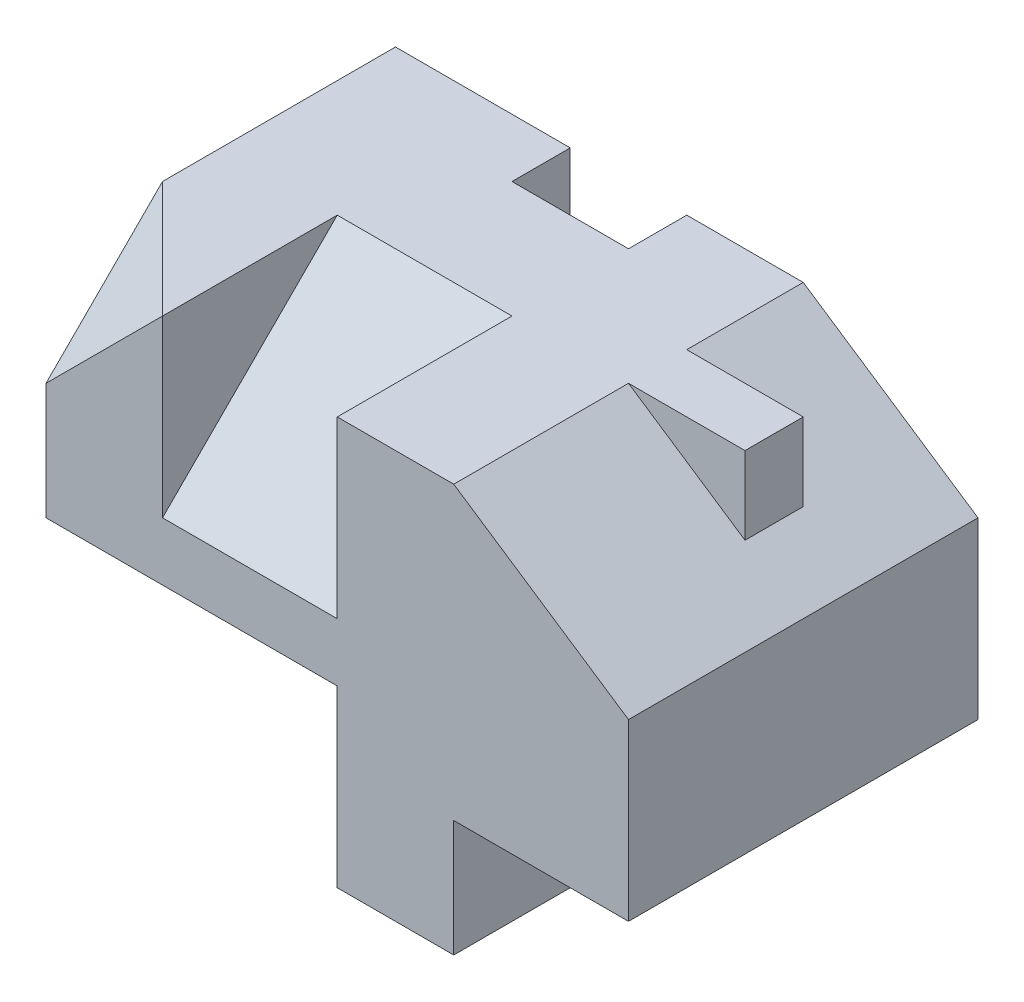
ISO-10303-21;
HEADER;
FILE_DESCRIPTION(('STEP AP214'),'2;1');
FILE_NAME('part.step','',(''),(''),'','','');
FILE_SCHEMA(('AUTOMOTIVE_DESIGN { 1 0 10303 214 1 1 1 1 }'));
ENDSEC;
DATA;
#1=APPLICATION_CONTEXT('core data for automotive mechanical design processes');
#2=APPLICATION_PROTOCOL_DEFINITION('international standard','automotive_design',2000,#1);
#3=PRODUCT_CONTEXT('',#1,'mechanical');
#4=PRODUCT('Part','Part','',(#3));
#5=PRODUCT_RELATED_PRODUCT_CATEGORY('part','',(#4));
#6=PRODUCT_DEFINITION_FORMATION('','',#4);
#7=PRODUCT_DEFINITION_CONTEXT('part definition',#1,'design');
#8=PRODUCT_DEFINITION('design','',#6,#7);
#9=PRODUCT_DEFINITION_SHAPE('','',#8);
#10=(LENGTH_UNIT() NAMED_UNIT(*) SI_UNIT(.MILLI.,.METRE.));
#11=(NAMED_UNIT(*) PLANE_ANGLE_UNIT() SI_UNIT($,.RADIAN.));
#12=(NAMED_UNIT(*) SI_UNIT($,.STERADIAN.) SOLID_ANGLE_UNIT());
#13=UNCERTAINTY_MEASURE_WITH_UNIT(LENGTH_MEASURE(1.E-05),#10,'distance_accuracy_value','');
#14=(GEOMETRIC_REPRESENTATION_CONTEXT(3) GLOBAL_UNCERTAINTY_ASSIGNED_CONTEXT((#13)) GLOBAL_UNIT_ASSIGNED_CONTEXT((#10,
#11,#12)) REPRESENTATION_CONTEXT('',''));
#15=CARTESIAN_POINT('',(0.,0.,0.));
#16=DIRECTION('',(0.,0.,1.));
#17=DIRECTION('',(1.,0.,0.));
#18=AXIS2_PLACEMENT_3D('',#15,#16,#17);
#19=CARTESIAN_POINT('',(0.,3.,0.));
#20=DIRECTION('',(0.,1.,0.));
#21=DIRECTION('',(0.,0.,1.));
#22=AXIS2_PLACEMENT_3D('',#19,#20,#21);
#23=PLANE('',#22);
#24=DIRECTION('',(0.,0.,1.));
#25=VECTOR('',#24,1.);
#26=CARTESIAN_POINT('',(5.,3.,-2.));
#27=LINE('',#26,#25);
#28=CARTESIAN_POINT('',(5.,3.,-2.));
#29=VERTEX_POINT('',#28);
#30=CARTESIAN_POINT('',(5.,3.,-1.));
#31=VERTEX_POINT('',#30);
#32=EDGE_CURVE('E332',#29,#31,#27,.T.);
#33=ORIENTED_EDGE('',*,*,#32,.T.);
#34=DIRECTION('',(1.,0.,0.));
#35=VECTOR('',#34,1.);
#36=CARTESIAN_POINT('',(0.,3.,-1.));
#37=LINE('',#36,#35);
#38=CARTESIAN_POINT('',(7.,3.,-1.));
#39=VERTEX_POINT('',#38);
#40=EDGE_CURVE('E274',#31,#39,#37,.T.);
#41=ORIENTED_EDGE('',*,*,#40,.T.);
#42=DIRECTION('',(0.,0.,-1.));
#43=VECTOR('',#42,1.);
#44=CARTESIAN_POINT('',(7.,3.,5.));
#45=LINE('',#44,#43);
#46=CARTESIAN_POINT('',(7.,3.,-2.));
#47=VERTEX_POINT('',#46);
#48=EDGE_CURVE('E324',#39,#47,#45,.T.);
#49=ORIENTED_EDGE('',*,*,#48,.T.);
#50=DIRECTION('',(-1.,0.,0.));
#51=VECTOR('',#50,1.);
#52=CARTESIAN_POINT('',(7.,3.,-2.));
#53=LINE('',#52,#51);
#54=EDGE_CURVE('E330',#47,#29,#53,.T.);
#55=ORIENTED_EDGE('',*,*,#54,.T.);
#56=EDGE_LOOP('',(#33,#41,#49,#55));
#57=FACE_BOUND('',#56,.T.);
#58=ADVANCED_FACE('F36',(#57),#23,.T.);
#59=CARTESIAN_POINT('',(0.,3.,-2.));
#60=DIRECTION('',(1.,0.,0.));
#61=DIRECTION('',(0.,0.,-1.));
#62=AXIS2_PLACEMENT_3D('',#59,#60,#61);
#63=PLANE('',#62);
#64=DIRECTION('',(0.,-1.,0.));
#65=VECTOR('',#64,1.);
#66=CARTESIAN_POINT('',(0.,7.,5.));
#67=LINE('',#66,#65);
#68=CARTESIAN_POINT('',(0.,5.,5.));
#69=VERTEX_POINT('',#68);
#70=CARTESIAN_POINT('',(0.,3.,5.));
#71=VERTEX_POINT('',#70);
#72=EDGE_CURVE('E262',#69,#71,#67,.T.);
#73=ORIENTED_EDGE('',*,*,#72,.F.);
#74=DIRECTION('',(0.,-0.707106781186548,0.707106781186548));
#75=VECTOR('',#74,1.);
#76=CARTESIAN_POINT('',(0.,7.,3.));
#77=LINE('',#76,#75);
#78=CARTESIAN_POINT('',(0.,7.,3.));
#79=VERTEX_POINT('',#78);
#80=EDGE_CURVE('E422',#79,#69,#77,.T.);
#81=ORIENTED_EDGE('',*,*,#80,.F.);
#82=DIRECTION('',(0.,0.,1.));
#83=VECTOR('',#82,1.);
#84=CARTESIAN_POINT('',(0.,7.,0.));
#85=LINE('',#84,#83);
#86=CARTESIAN_POINT('',(0.,7.,-1.));
#87=VERTEX_POINT('',#86);
#88=EDGE_CURVE('E292',#87,#79,#85,.T.);
#89=ORIENTED_EDGE('',*,*,#88,.F.);
#90=DIRECTION('',(0.,-1.,0.));
#91=VECTOR('',#90,1.);
#92=CARTESIAN_POINT('',(0.,7.,-1.));
#93=LINE('',#92,#91);
#94=CARTESIAN_POINT('',(0.,3.,-1.));
#95=VERTEX_POINT('',#94);
#96=EDGE_CURVE('E258',#87,#95,#93,.T.);
#97=ORIENTED_EDGE('',*,*,#96,.T.);
#98=DIRECTION('',(0.,0.,1.));
#99=VECTOR('',#98,1.);
#100=CARTESIAN_POINT('',(0.,3.,-2.));
#101=LINE('',#100,#99);
#102=CARTESIAN_POINT('',(0.,3.,-2.));
#103=VERTEX_POINT('',#102);
#104=EDGE_CURVE('E319',#103,#95,#101,.T.);
#105=ORIENTED_EDGE('',*,*,#104,.F.);
#106=DIRECTION('',(0.,-1.,0.));
#107=VECTOR('',#106,1.);
#108=CARTESIAN_POINT('',(0.,3.,-2.));
#109=LINE('',#108,#107);
#110=CARTESIAN_POINT('',(0.,0.,-2.));
#111=VERTEX_POINT('',#110);
#112=EDGE_CURVE('E342',#103,#111,#109,.T.);
#113=ORIENTED_EDGE('',*,*,#112,.T.);
#114=DIRECTION('',(0.,0.,1.));
#115=VECTOR('',#114,1.);
#116=CARTESIAN_POINT('',(0.,0.,-2.));
#117=LINE('',#116,#115);
#118=CARTESIAN_POINT('',(0.,0.,0.));
#119=VERTEX_POINT('',#118);
#120=EDGE_CURVE('E267',#111,#119,#117,.T.);
#121=ORIENTED_EDGE('',*,*,#120,.T.);
#122=DIRECTION('',(0.,-1.,0.));
#123=VECTOR('',#122,1.);
#124=CARTESIAN_POINT('',(0.,3.,0.));
#125=LINE('',#124,#123);
#126=CARTESIAN_POINT('',(0.,3.,0.));
#127=VERTEX_POINT('',#126);
#128=EDGE_CURVE('E45',#127,#119,#125,.T.);
#129=ORIENTED_EDGE('',*,*,#128,.F.);
#130=DIRECTION('',(0.,0.,1.));
#131=VECTOR('',#130,1.);
#132=CARTESIAN_POINT('',(0.,3.,0.));
#133=LINE('',#132,#131);
#134=EDGE_CURVE('E253',#127,#71,#133,.T.);
#135=ORIENTED_EDGE('',*,*,#134,.T.);
#136=EDGE_LOOP('',(#73,#81,#89,#97,#105,#113,#121,#129,#135));
#137=FACE_BOUND('',#136,.T.);
#138=ADVANCED_FACE('F38',(#137),#63,.F.);
#139=CARTESIAN_POINT('',(0.,3.,0.));
#140=DIRECTION('',(0.,0.,-1.));
#141=DIRECTION('',(-1.,0.,0.));
#142=AXIS2_PLACEMENT_3D('',#139,#140,#141);
#143=PLANE('',#142);
#144=DIRECTION('',(1.,0.,0.));
#145=VECTOR('',#144,1.);
#146=CARTESIAN_POINT('',(0.,0.,0.));
#147=LINE('',#146,#145);
#148=CARTESIAN_POINT('',(2.,0.,0.));
#149=VERTEX_POINT('',#148);
#150=EDGE_CURVE('E351',#119,#149,#147,.T.);
#151=ORIENTED_EDGE('',*,*,#150,.T.);
#152=DIRECTION('',(0.,-1.,0.));
#153=VECTOR('',#152,1.);
#154=CARTESIAN_POINT('',(2.,3.,0.));
#155=LINE('',#154,#153);
#156=CARTESIAN_POINT('',(2.,3.,0.));
#157=VERTEX_POINT('',#156);
#158=EDGE_CURVE('E316',#157,#149,#155,.T.);
#159=ORIENTED_EDGE('',*,*,#158,.F.);
#160=DIRECTION('',(1.,0.,0.));
#161=VECTOR('',#160,1.);
#162=CARTESIAN_POINT('',(0.,3.,0.));
#163=LINE('',#162,#161);
#164=EDGE_CURVE('E322',#127,#157,#163,.T.);
#165=ORIENTED_EDGE('',*,*,#164,.F.);
#166=ORIENTED_EDGE('',*,*,#128,.T.);
#167=EDGE_LOOP('',(#151,#159,#165,#166));
#168=FACE_BOUND('',#167,.T.);
#169=ADVANCED_FACE('F513',(#168),#143,.F.);
#170=CARTESIAN_POINT('',(2.,3.,0.));
#171=DIRECTION('',(0.857492925712544,0.,-0.514495755427527));
#172=DIRECTION('',(-0.514495755427527,0.,-0.857492925712544));
#173=AXIS2_PLACEMENT_3D('',#170,#171,#172);
#174=PLANE('',#173);
#175=DIRECTION('',(0.514495755427527,0.,0.857492925712544));
#176=VECTOR('',#175,1.);
#177=CARTESIAN_POINT('',(2.,0.,0.));
#178=LINE('',#177,#176);
#179=CARTESIAN_POINT('',(5.,0.,5.));
#180=VERTEX_POINT('',#179);
#181=EDGE_CURVE('E353',#149,#180,#178,.T.);
#182=ORIENTED_EDGE('',*,*,#181,.T.);
#183=DIRECTION('',(0.,-1.,0.));
#184=VECTOR('',#183,1.);
#185=CARTESIAN_POINT('',(5.,3.,5.));
#186=LINE('',#185,#184);
#187=CARTESIAN_POINT('',(5.,3.,5.));
#188=VERTEX_POINT('',#187);
#189=EDGE_CURVE('E308',#188,#180,#186,.T.);
#190=ORIENTED_EDGE('',*,*,#189,.F.);
#191=DIRECTION('',(0.514495755427527,0.,0.857492925712544));
#192=VECTOR('',#191,1.);
#193=CARTESIAN_POINT('',(2.,3.,0.));
#194=LINE('',#193,#192);
#195=EDGE_CURVE('E280',#157,#188,#194,.T.);
#196=ORIENTED_EDGE('',*,*,#195,.F.);
#197=ORIENTED_EDGE('',*,*,#158,.T.);
#198=EDGE_LOOP('',(#182,#190,#196,#197));
#199=FACE_BOUND('',#198,.T.);
#200=ADVANCED_FACE('F573',(#199),#174,.F.);
#201=CARTESIAN_POINT('',(5.,3.,5.));
#202=DIRECTION('',(0.,0.,-1.));
#203=DIRECTION('',(-1.,0.,0.));
#204=AXIS2_PLACEMENT_3D('',#201,#202,#203);
#205=PLANE('',#204);
#206=DIRECTION('',(0.,1.,0.));
#207=VECTOR('',#206,1.);
#208=CARTESIAN_POINT('',(2.,4.,5.));
#209=LINE('',#208,#207);
#210=CARTESIAN_POINT('',(2.,4.,5.));
#211=VERTEX_POINT('',#210);
#212=CARTESIAN_POINT('',(2.,7.,5.));
#213=VERTEX_POINT('',#212);
#214=EDGE_CURVE('E298',#211,#213,#209,.T.);
#215=ORIENTED_EDGE('',*,*,#214,.T.);
#216=DIRECTION('',(0.707106781186547,0.707106781186548,0.));
#217=VECTOR('',#216,1.);
#218=CARTESIAN_POINT('',(0.,5.,5.));
#219=LINE('',#218,#217);
#220=EDGE_CURVE('E427',#69,#213,#219,.T.);
#221=ORIENTED_EDGE('',*,*,#220,.F.);
#222=ORIENTED_EDGE('',*,*,#72,.T.);
#223=DIRECTION('',(1.,0.,0.));
#224=VECTOR('',#223,1.);
#225=CARTESIAN_POINT('',(0.,3.,5.));
#226=LINE('',#225,#224);
#227=EDGE_CURVE('E279',#71,#188,#226,.T.);
#228=ORIENTED_EDGE('',*,*,#227,.T.);
#229=ORIENTED_EDGE('',*,*,#189,.T.);
#230=DIRECTION('',(1.,0.,0.));
#231=VECTOR('',#230,1.);
#232=CARTESIAN_POINT('',(5.,0.,5.));
#233=LINE('',#232,#231);
#234=CARTESIAN_POINT('',(7.,0.,5.));
#235=VERTEX_POINT('',#234);
#236=EDGE_CURVE('E355',#180,#235,#233,.T.);
#237=ORIENTED_EDGE('',*,*,#236,.T.);
#238=DIRECTION('',(0.,-1.,0.));
#239=VECTOR('',#238,1.);
#240=CARTESIAN_POINT('',(7.,3.,5.));
#241=LINE('',#240,#239);
#242=CARTESIAN_POINT('',(7.,2.,5.));
#243=VERTEX_POINT('',#242);
#244=EDGE_CURVE('E306',#243,#235,#241,.T.);
#245=ORIENTED_EDGE('',*,*,#244,.F.);
#246=DIRECTION('',(1.,0.,0.));
#247=VECTOR('',#246,1.);
#248=CARTESIAN_POINT('',(10.,2.,5.));
#249=LINE('',#248,#247);
#250=CARTESIAN_POINT('',(10.,2.,5.));
#251=VERTEX_POINT('',#250);
#252=EDGE_CURVE('E443',#243,#251,#249,.T.);
#253=ORIENTED_EDGE('',*,*,#252,.T.);
#254=DIRECTION('',(0.,1.,0.));
#255=VECTOR('',#254,1.);
#256=CARTESIAN_POINT('',(10.,5.,5.));
#257=LINE('',#256,#255);
#258=CARTESIAN_POINT('',(10.,5.,5.));
#259=VERTEX_POINT('',#258);
#260=EDGE_CURVE('E445',#251,#259,#257,.T.);
#261=ORIENTED_EDGE('',*,*,#260,.T.);
#262=DIRECTION('',(-0.832050294337844,0.554700196225229,0.));
#263=VECTOR('',#262,1.);
#264=CARTESIAN_POINT('',(7.,7.,5.));
#265=LINE('',#264,#263);
#266=CARTESIAN_POINT('',(7.,7.,5.));
#267=VERTEX_POINT('',#266);
#268=EDGE_CURVE('E452',#259,#267,#265,.T.);
#269=ORIENTED_EDGE('',*,*,#268,.T.);
#270=DIRECTION('',(1.,0.,0.));
#271=VECTOR('',#270,1.);
#272=CARTESIAN_POINT('',(0.,7.,5.));
#273=LINE('',#272,#271);
#274=CARTESIAN_POINT('',(5.,7.,5.));
#275=VERTEX_POINT('',#274);
#276=EDGE_CURVE('E228',#275,#267,#273,.T.);
#277=ORIENTED_EDGE('',*,*,#276,.F.);
#278=DIRECTION('',(0.,1.,0.));
#279=VECTOR('',#278,1.);
#280=CARTESIAN_POINT('',(5.,4.,5.));
#281=LINE('',#280,#279);
#282=CARTESIAN_POINT('',(5.,4.,5.));
#283=VERTEX_POINT('',#282);
#284=EDGE_CURVE('E417',#283,#275,#281,.T.);
#285=ORIENTED_EDGE('',*,*,#284,.F.);
#286=DIRECTION('',(1.,0.,0.));
#287=VECTOR('',#286,1.);
#288=CARTESIAN_POINT('',(2.,4.,5.));
#289=LINE('',#288,#287);
#290=EDGE_CURVE('E254',#211,#283,#289,.T.);
#291=ORIENTED_EDGE('',*,*,#290,.F.);
#292=EDGE_LOOP('',(#215,#221,#222,#228,#229,#237,#245,#253,#261,#269,#277,#285,#291));
#293=FACE_BOUND('',#292,.T.);
#294=ADVANCED_FACE('F474',(#293),#205,.F.);
#295=CARTESIAN_POINT('',(7.,3.,5.));
#296=DIRECTION('',(-1.,0.,0.));
#297=DIRECTION('',(0.,0.,1.));
#298=AXIS2_PLACEMENT_3D('',#295,#296,#297);
#299=PLANE('',#298);
#300=DIRECTION('',(0.,-1.,0.));
#301=VECTOR('',#300,1.);
#302=CARTESIAN_POINT('',(7.,2.,-1.));
#303=LINE('',#302,#301);
#304=CARTESIAN_POINT('',(7.,2.,-1.));
#305=VERTEX_POINT('',#304);
#306=EDGE_CURVE('E12',#39,#305,#303,.T.);
#307=ORIENTED_EDGE('',*,*,#306,.T.);
#308=DIRECTION('',(0.,0.,1.));
#309=VECTOR('',#308,1.);
#310=CARTESIAN_POINT('',(7.,2.,-1.));
#311=LINE('',#310,#309);
#312=EDGE_CURVE('E441',#305,#243,#311,.T.);
#313=ORIENTED_EDGE('',*,*,#312,.T.);
#314=ORIENTED_EDGE('',*,*,#244,.T.);
#315=DIRECTION('',(0.,0.,-1.));
#316=VECTOR('',#315,1.);
#317=CARTESIAN_POINT('',(7.,0.,5.));
#318=LINE('',#317,#316);
#319=CARTESIAN_POINT('',(7.,0.,-2.));
#320=VERTEX_POINT('',#319);
#321=EDGE_CURVE('E358',#235,#320,#318,.T.);
#322=ORIENTED_EDGE('',*,*,#321,.T.);
#323=DIRECTION('',(0.,-1.,0.));
#324=VECTOR('',#323,1.);
#325=CARTESIAN_POINT('',(7.,3.,-2.));
#326=LINE('',#325,#324);
#327=EDGE_CURVE('E309',#47,#320,#326,.T.);
#328=ORIENTED_EDGE('',*,*,#327,.F.);
#329=ORIENTED_EDGE('',*,*,#48,.F.);
#330=EDGE_LOOP('',(#307,#313,#314,#322,#328,#329));
#331=FACE_BOUND('',#330,.T.);
#332=ADVANCED_FACE('F572',(#331),#299,.F.);
#333=CARTESIAN_POINT('',(7.,3.,-2.));
#334=DIRECTION('',(0.,0.,1.));
#335=DIRECTION('',(1.,0.,0.));
#336=AXIS2_PLACEMENT_3D('',#333,#334,#335);
#337=PLANE('',#336);
#338=DIRECTION('',(-1.,0.,0.));
#339=VECTOR('',#338,1.);
#340=CARTESIAN_POINT('',(7.,0.,-2.));
#341=LINE('',#340,#339);
#342=CARTESIAN_POINT('',(5.,0.,-2.));
#343=VERTEX_POINT('',#342);
#344=EDGE_CURVE('E360',#320,#343,#341,.T.);
#345=ORIENTED_EDGE('',*,*,#344,.T.);
#346=DIRECTION('',(0.,-1.,0.));
#347=VECTOR('',#346,1.);
#348=CARTESIAN_POINT('',(5.,3.,-2.));
#349=LINE('',#348,#347);
#350=EDGE_CURVE('E376',#29,#343,#349,.T.);
#351=ORIENTED_EDGE('',*,*,#350,.F.);
#352=ORIENTED_EDGE('',*,*,#54,.F.);
#353=ORIENTED_EDGE('',*,*,#327,.T.);
#354=EDGE_LOOP('',(#345,#351,#352,#353));
#355=FACE_BOUND('',#354,.T.);
#356=ADVANCED_FACE('F386',(#355),#337,.F.);
#357=CARTESIAN_POINT('',(5.,3.,-2.));
#358=DIRECTION('',(1.,0.,0.));
#359=DIRECTION('',(0.,0.,-1.));
#360=AXIS2_PLACEMENT_3D('',#357,#358,#359);
#361=PLANE('',#360);
#362=DIRECTION('',(0.,0.,1.));
#363=VECTOR('',#362,1.);
#364=CARTESIAN_POINT('',(5.,0.,-2.));
#365=LINE('',#364,#363);
#366=CARTESIAN_POINT('',(5.,0.,0.));
#367=VERTEX_POINT('',#366);
#368=EDGE_CURVE('E362',#343,#367,#365,.T.);
#369=ORIENTED_EDGE('',*,*,#368,.T.);
#370=DIRECTION('',(0.,-1.,0.));
#371=VECTOR('',#370,1.);
#372=CARTESIAN_POINT('',(5.,3.,0.));
#373=LINE('',#372,#371);
#374=CARTESIAN_POINT('',(5.,7.,0.));
#375=VERTEX_POINT('',#374);
#376=EDGE_CURVE('E374',#375,#367,#373,.T.);
#377=ORIENTED_EDGE('',*,*,#376,.F.);
#378=DIRECTION('',(0.,0.,1.));
#379=VECTOR('',#378,1.);
#380=CARTESIAN_POINT('',(5.,7.,0.));
#381=LINE('',#380,#379);
#382=CARTESIAN_POINT('',(5.,7.,-1.));
#383=VERTEX_POINT('',#382);
#384=EDGE_CURVE('E233',#383,#375,#381,.T.);
#385=ORIENTED_EDGE('',*,*,#384,.F.);
#386=DIRECTION('',(0.,-1.,0.));
#387=VECTOR('',#386,1.);
#388=CARTESIAN_POINT('',(5.,7.,-1.));
#389=LINE('',#388,#387);
#390=EDGE_CURVE('E243',#383,#31,#389,.T.);
#391=ORIENTED_EDGE('',*,*,#390,.T.);
#392=ORIENTED_EDGE('',*,*,#32,.F.);
#393=ORIENTED_EDGE('',*,*,#350,.T.);
#394=EDGE_LOOP('',(#369,#377,#385,#391,#392,#393));
#395=FACE_BOUND('',#394,.T.);
#396=ADVANCED_FACE('F396',(#395),#361,.F.);
#397=CARTESIAN_POINT('',(5.,3.,0.));
#398=DIRECTION('',(0.,0.,1.));
#399=DIRECTION('',(1.,0.,0.));
#400=AXIS2_PLACEMENT_3D('',#397,#398,#399);
#401=PLANE('',#400);
#402=DIRECTION('',(-1.,0.,0.));
#403=VECTOR('',#402,1.);
#404=CARTESIAN_POINT('',(5.,0.,0.));
#405=LINE('',#404,#403);
#406=CARTESIAN_POINT('',(3.,0.,0.));
#407=VERTEX_POINT('',#406);
#408=EDGE_CURVE('E364',#367,#407,#405,.T.);
#409=ORIENTED_EDGE('',*,*,#408,.T.);
#410=DIRECTION('',(0.,-1.,0.));
#411=VECTOR('',#410,1.);
#412=CARTESIAN_POINT('',(3.,3.,0.));
#413=LINE('',#412,#411);
#414=CARTESIAN_POINT('',(3.,7.,0.));
#415=VERTEX_POINT('',#414);
#416=EDGE_CURVE('E371',#415,#407,#413,.T.);
#417=ORIENTED_EDGE('',*,*,#416,.F.);
#418=DIRECTION('',(-1.,0.,0.));
#419=VECTOR('',#418,1.);
#420=CARTESIAN_POINT('',(0.,7.,0.));
#421=LINE('',#420,#419);
#422=EDGE_CURVE('E240',#375,#415,#421,.T.);
#423=ORIENTED_EDGE('',*,*,#422,.F.);
#424=ORIENTED_EDGE('',*,*,#376,.T.);
#425=EDGE_LOOP('',(#409,#417,#423,#424));
#426=FACE_BOUND('',#425,.T.);
#427=ADVANCED_FACE('F400',(#426),#401,.F.);
#428=CARTESIAN_POINT('',(3.,3.,0.));
#429=DIRECTION('',(-1.,0.,0.));
#430=DIRECTION('',(0.,0.,1.));
#431=AXIS2_PLACEMENT_3D('',#428,#429,#430);
#432=PLANE('',#431);
#433=DIRECTION('',(0.,0.,-1.));
#434=VECTOR('',#433,1.);
#435=CARTESIAN_POINT('',(3.,0.,0.));
#436=LINE('',#435,#434);
#437=CARTESIAN_POINT('',(3.,0.,-2.));
#438=VERTEX_POINT('',#437);
#439=EDGE_CURVE('E366',#407,#438,#436,.T.);
#440=ORIENTED_EDGE('',*,*,#439,.T.);
#441=DIRECTION('',(0.,-1.,0.));
#442=VECTOR('',#441,1.);
#443=CARTESIAN_POINT('',(3.,3.,-2.));
#444=LINE('',#443,#442);
#445=CARTESIAN_POINT('',(3.,3.,-2.));
#446=VERTEX_POINT('',#445);
#447=EDGE_CURVE('E346',#446,#438,#444,.T.);
#448=ORIENTED_EDGE('',*,*,#447,.F.);
#449=DIRECTION('',(0.,0.,-1.));
#450=VECTOR('',#449,1.);
#451=CARTESIAN_POINT('',(3.,3.,0.));
#452=LINE('',#451,#450);
#453=CARTESIAN_POINT('',(3.,3.,-1.));
#454=VERTEX_POINT('',#453);
#455=EDGE_CURVE('E255',#454,#446,#452,.T.);
#456=ORIENTED_EDGE('',*,*,#455,.F.);
#457=DIRECTION('',(0.,-1.,0.));
#458=VECTOR('',#457,1.);
#459=CARTESIAN_POINT('',(3.,7.,-1.));
#460=LINE('',#459,#458);
#461=CARTESIAN_POINT('',(3.,7.,-1.));
#462=VERTEX_POINT('',#461);
#463=EDGE_CURVE('E261',#462,#454,#460,.T.);
#464=ORIENTED_EDGE('',*,*,#463,.F.);
#465=DIRECTION('',(0.,0.,-1.));
#466=VECTOR('',#465,1.);
#467=CARTESIAN_POINT('',(3.,7.,0.));
#468=LINE('',#467,#466);
#469=EDGE_CURVE('E278',#415,#462,#468,.T.);
#470=ORIENTED_EDGE('',*,*,#469,.F.);
#471=ORIENTED_EDGE('',*,*,#416,.T.);
#472=EDGE_LOOP('',(#440,#448,#456,#464,#470,#471));
#473=FACE_BOUND('',#472,.T.);
#474=ADVANCED_FACE('F406',(#473),#432,.F.);
#475=CARTESIAN_POINT('',(3.,3.,-2.));
#476=DIRECTION('',(0.,0.,1.));
#477=DIRECTION('',(1.,0.,0.));
#478=AXIS2_PLACEMENT_3D('',#475,#476,#477);
#479=PLANE('',#478);
#480=DIRECTION('',(-1.,0.,0.));
#481=VECTOR('',#480,1.);
#482=CARTESIAN_POINT('',(3.,0.,-2.));
#483=LINE('',#482,#481);
#484=EDGE_CURVE('E323',#438,#111,#483,.T.);
#485=ORIENTED_EDGE('',*,*,#484,.T.);
#486=ORIENTED_EDGE('',*,*,#112,.F.);
#487=DIRECTION('',(-1.,0.,0.));
#488=VECTOR('',#487,1.);
#489=CARTESIAN_POINT('',(3.,3.,-2.));
#490=LINE('',#489,#488);
#491=EDGE_CURVE('E338',#446,#103,#490,.T.);
#492=ORIENTED_EDGE('',*,*,#491,.F.);
#493=ORIENTED_EDGE('',*,*,#447,.T.);
#494=EDGE_LOOP('',(#485,#486,#492,#493));
#495=FACE_BOUND('',#494,.T.);
#496=ADVANCED_FACE('F517',(#495),#479,.F.);
#497=DIRECTION('',(-1.,0.,0.));
#498=VECTOR('',#497,1.);
#499=CARTESIAN_POINT('',(0.,3.,-1.));
#500=LINE('',#499,#498);
#501=EDGE_CURVE('E249',#454,#95,#500,.T.);
#502=ORIENTED_EDGE('',*,*,#501,.F.);
#503=ORIENTED_EDGE('',*,*,#455,.T.);
#504=ORIENTED_EDGE('',*,*,#491,.T.);
#505=ORIENTED_EDGE('',*,*,#104,.T.);
#506=EDGE_LOOP('',(#502,#503,#504,#505));
#507=FACE_BOUND('',#506,.T.);
#508=ADVANCED_FACE('F509',(#507),#23,.T.);
#509=CARTESIAN_POINT('',(0.,0.,0.));
#510=DIRECTION('',(0.,1.,0.));
#511=DIRECTION('',(0.,0.,1.));
#512=AXIS2_PLACEMENT_3D('',#509,#510,#511);
#513=PLANE('',#512);
#514=ORIENTED_EDGE('',*,*,#120,.F.);
#515=ORIENTED_EDGE('',*,*,#484,.F.);
#516=ORIENTED_EDGE('',*,*,#439,.F.);
#517=ORIENTED_EDGE('',*,*,#408,.F.);
#518=ORIENTED_EDGE('',*,*,#368,.F.);
#519=ORIENTED_EDGE('',*,*,#344,.F.);
#520=ORIENTED_EDGE('',*,*,#321,.F.);
#521=ORIENTED_EDGE('',*,*,#236,.F.);
#522=ORIENTED_EDGE('',*,*,#181,.F.);
#523=ORIENTED_EDGE('',*,*,#150,.F.);
#524=EDGE_LOOP('',(#514,#515,#516,#517,#518,#519,#520,#521,#522,#523));
#525=FACE_BOUND('',#524,.T.);
#526=ADVANCED_FACE('F392',(#525),#513,.F.);
#527=CARTESIAN_POINT('',(0.,3.,0.));
#528=DIRECTION('',(0.,1.,0.));
#529=DIRECTION('',(0.,0.,1.));
#530=AXIS2_PLACEMENT_3D('',#527,#528,#529);
#531=PLANE('',#530);
#532=ORIENTED_EDGE('',*,*,#134,.F.);
#533=ORIENTED_EDGE('',*,*,#164,.T.);
#534=ORIENTED_EDGE('',*,*,#195,.T.);
#535=ORIENTED_EDGE('',*,*,#227,.F.);
#536=EDGE_LOOP('',(#532,#533,#534,#535));
#537=FACE_BOUND('',#536,.T.);
#538=ADVANCED_FACE('F522',(#537),#531,.F.);
#539=CARTESIAN_POINT('',(0.,7.,-1.));
#540=DIRECTION('',(0.,0.,1.));
#541=DIRECTION('',(1.,0.,0.));
#542=AXIS2_PLACEMENT_3D('',#539,#540,#541);
#543=PLANE('',#542);
#544=ORIENTED_EDGE('',*,*,#501,.T.);
#545=ORIENTED_EDGE('',*,*,#96,.F.);
#546=DIRECTION('',(-1.,0.,0.));
#547=VECTOR('',#546,1.);
#548=CARTESIAN_POINT('',(0.,7.,-1.));
#549=LINE('',#548,#547);
#550=EDGE_CURVE('E407',#462,#87,#549,.T.);
#551=ORIENTED_EDGE('',*,*,#550,.F.);
#552=ORIENTED_EDGE('',*,*,#463,.T.);
#553=EDGE_LOOP('',(#544,#545,#551,#552));
#554=FACE_BOUND('',#553,.T.);
#555=ADVANCED_FACE('F526',(#554),#543,.F.);
#556=CARTESIAN_POINT('',(0.,7.,-1.));
#557=DIRECTION('',(0.,0.,-1.));
#558=DIRECTION('',(-1.,0.,0.));
#559=AXIS2_PLACEMENT_3D('',#556,#557,#558);
#560=PLANE('',#559);
#561=ORIENTED_EDGE('',*,*,#40,.F.);
#562=ORIENTED_EDGE('',*,*,#390,.F.);
#563=DIRECTION('',(1.,0.,0.));
#564=VECTOR('',#563,1.);
#565=CARTESIAN_POINT('',(0.,7.,-1.));
#566=LINE('',#565,#564);
#567=CARTESIAN_POINT('',(7.,7.,-1.));
#568=VERTEX_POINT('',#567);
#569=EDGE_CURVE('E229',#383,#568,#566,.T.);
#570=ORIENTED_EDGE('',*,*,#569,.T.);
#571=DIRECTION('',(-0.832050294337844,0.554700196225229,0.));
#572=VECTOR('',#571,1.);
#573=CARTESIAN_POINT('',(7.,7.,-1.));
#574=LINE('',#573,#572);
#575=CARTESIAN_POINT('',(10.,5.,-1.));
#576=VERTEX_POINT('',#575);
#577=EDGE_CURVE('E442',#576,#568,#574,.T.);
#578=ORIENTED_EDGE('',*,*,#577,.F.);
#579=DIRECTION('',(0.,1.,0.));
#580=VECTOR('',#579,1.);
#581=CARTESIAN_POINT('',(10.,5.,-1.));
#582=LINE('',#581,#580);
#583=CARTESIAN_POINT('',(10.,2.,-1.));
#584=VERTEX_POINT('',#583);
#585=EDGE_CURVE('E463',#584,#576,#582,.T.);
#586=ORIENTED_EDGE('',*,*,#585,.F.);
#587=DIRECTION('',(1.,0.,0.));
#588=VECTOR('',#587,1.);
#589=CARTESIAN_POINT('',(10.,2.,-1.));
#590=LINE('',#589,#588);
#591=EDGE_CURVE('E61',#305,#584,#590,.T.);
#592=ORIENTED_EDGE('',*,*,#591,.F.);
#593=ORIENTED_EDGE('',*,*,#306,.F.);
#594=EDGE_LOOP('',(#561,#562,#570,#578,#586,#592,#593));
#595=FACE_BOUND('',#594,.T.);
#596=ADVANCED_FACE('F473',(#595),#560,.T.);
#597=CARTESIAN_POINT('',(0.,7.,0.));
#598=DIRECTION('',(0.,1.,0.));
#599=DIRECTION('',(0.,0.,1.));
#600=AXIS2_PLACEMENT_3D('',#597,#598,#599);
#601=PLANE('',#600);
#602=DIRECTION('',(-0.707106781186547,0.,-0.707106781186548));
#603=VECTOR('',#602,1.);
#604=CARTESIAN_POINT('',(2.,7.,5.));
#605=LINE('',#604,#603);
#606=EDGE_CURVE('E429',#213,#79,#605,.T.);
#607=ORIENTED_EDGE('',*,*,#606,.F.);
#608=DIRECTION('',(0.,0.,-1.));
#609=VECTOR('',#608,1.);
#610=CARTESIAN_POINT('',(2.,7.,5.));
#611=LINE('',#610,#609);
#612=CARTESIAN_POINT('',(2.,7.,2.));
#613=VERTEX_POINT('',#612);
#614=EDGE_CURVE('E294',#213,#613,#611,.T.);
#615=ORIENTED_EDGE('',*,*,#614,.T.);
#616=DIRECTION('',(1.,0.,0.));
#617=VECTOR('',#616,1.);
#618=CARTESIAN_POINT('',(2.,7.,2.));
#619=LINE('',#618,#617);
#620=CARTESIAN_POINT('',(5.,7.,2.));
#621=VERTEX_POINT('',#620);
#622=EDGE_CURVE('E297',#613,#621,#619,.T.);
#623=ORIENTED_EDGE('',*,*,#622,.T.);
#624=DIRECTION('',(0.,0.,-1.));
#625=VECTOR('',#624,1.);
#626=CARTESIAN_POINT('',(5.,7.,5.));
#627=LINE('',#626,#625);
#628=EDGE_CURVE('E415',#275,#621,#627,.T.);
#629=ORIENTED_EDGE('',*,*,#628,.F.);
#630=ORIENTED_EDGE('',*,*,#276,.T.);
#631=DIRECTION('',(0.,0.,-1.));
#632=VECTOR('',#631,1.);
#633=CARTESIAN_POINT('',(7.,7.,0.));
#634=LINE('',#633,#632);
#635=CARTESIAN_POINT('',(7.,7.,2.));
#636=VERTEX_POINT('',#635);
#637=EDGE_CURVE('E218',#267,#636,#634,.T.);
#638=ORIENTED_EDGE('',*,*,#637,.T.);
#639=DIRECTION('',(1.,0.,0.));
#640=VECTOR('',#639,1.);
#641=CARTESIAN_POINT('',(7.,7.,2.));
#642=LINE('',#641,#640);
#643=CARTESIAN_POINT('',(9.,7.,2.));
#644=VERTEX_POINT('',#643);
#645=EDGE_CURVE('E203',#636,#644,#642,.T.);
#646=ORIENTED_EDGE('',*,*,#645,.T.);
#647=DIRECTION('',(0.,0.,-1.));
#648=VECTOR('',#647,1.);
#649=CARTESIAN_POINT('',(9.,7.,1.));
#650=LINE('',#649,#648);
#651=CARTESIAN_POINT('',(9.,7.,1.));
#652=VERTEX_POINT('',#651);
#653=EDGE_CURVE('E211',#644,#652,#650,.T.);
#654=ORIENTED_EDGE('',*,*,#653,.T.);
#655=DIRECTION('',(-1.,0.,0.));
#656=VECTOR('',#655,1.);
#657=CARTESIAN_POINT('',(7.,7.,1.));
#658=LINE('',#657,#656);
#659=CARTESIAN_POINT('',(7.,7.,1.));
#660=VERTEX_POINT('',#659);
#661=EDGE_CURVE('E53',#652,#660,#658,.T.);
#662=ORIENTED_EDGE('',*,*,#661,.T.);
#663=EDGE_CURVE('E230',#660,#568,#634,.T.);
#664=ORIENTED_EDGE('',*,*,#663,.T.);
#665=ORIENTED_EDGE('',*,*,#569,.F.);
#666=ORIENTED_EDGE('',*,*,#384,.T.);
#667=ORIENTED_EDGE('',*,*,#422,.T.);
#668=ORIENTED_EDGE('',*,*,#469,.T.);
#669=ORIENTED_EDGE('',*,*,#550,.T.);
#670=ORIENTED_EDGE('',*,*,#88,.T.);
#671=EDGE_LOOP('',(#607,#615,#623,#629,#630,#638,#646,#654,#662,#664,#665,#666,#667,#668,#669,#670));
#672=FACE_BOUND('',#671,.T.);
#673=ADVANCED_FACE('F225',(#672),#601,.T.);
#674=CARTESIAN_POINT('',(2.,7.,2.));
#675=DIRECTION('',(0.,0.707106781186547,0.707106781186548));
#676=DIRECTION('',(0.,-0.707106781186548,0.707106781186547));
#677=AXIS2_PLACEMENT_3D('',#674,#675,#676);
#678=PLANE('',#677);
#679=DIRECTION('',(0.,-0.707106781186548,0.707106781186547));
#680=VECTOR('',#679,1.);
#681=CARTESIAN_POINT('',(5.,7.,2.));
#682=LINE('',#681,#680);
#683=EDGE_CURVE('E419',#621,#283,#682,.T.);
#684=ORIENTED_EDGE('',*,*,#683,.F.);
#685=ORIENTED_EDGE('',*,*,#622,.F.);
#686=DIRECTION('',(0.,-0.707106781186548,0.707106781186547));
#687=VECTOR('',#686,1.);
#688=CARTESIAN_POINT('',(2.,7.,2.));
#689=LINE('',#688,#687);
#690=EDGE_CURVE('E303',#613,#211,#689,.T.);
#691=ORIENTED_EDGE('',*,*,#690,.T.);
#692=ORIENTED_EDGE('',*,*,#290,.T.);
#693=EDGE_LOOP('',(#684,#685,#691,#692));
#694=FACE_BOUND('',#693,.T.);
#695=ADVANCED_FACE('F495',(#694),#678,.T.);
#696=CARTESIAN_POINT('',(2.,0.,0.));
#697=DIRECTION('',(-1.,0.,0.));
#698=DIRECTION('',(0.,0.,1.));
#699=AXIS2_PLACEMENT_3D('',#696,#697,#698);
#700=PLANE('',#699);
#701=ORIENTED_EDGE('',*,*,#690,.F.);
#702=ORIENTED_EDGE('',*,*,#614,.F.);
#703=ORIENTED_EDGE('',*,*,#214,.F.);
#704=EDGE_LOOP('',(#701,#702,#703));
#705=FACE_BOUND('',#704,.T.);
#706=ADVANCED_FACE('F492',(#705),#700,.F.);
#707=CARTESIAN_POINT('',(5.,0.,0.));
#708=DIRECTION('',(-1.,0.,0.));
#709=DIRECTION('',(0.,0.,1.));
#710=AXIS2_PLACEMENT_3D('',#707,#708,#709);
#711=PLANE('',#710);
#712=ORIENTED_EDGE('',*,*,#683,.T.);
#713=ORIENTED_EDGE('',*,*,#284,.T.);
#714=ORIENTED_EDGE('',*,*,#628,.T.);
#715=EDGE_LOOP('',(#712,#713,#714));
#716=FACE_BOUND('',#715,.T.);
#717=ADVANCED_FACE('F497',(#716),#711,.T.);
#718=CARTESIAN_POINT('',(-3.33333333333334,3.33333333333332,3.33333333333332));
#719=DIRECTION('',(0.577350269189628,-0.577350269189625,-0.577350269189625));
#720=DIRECTION('',(-0.707106781186546,0.,-0.707106781186549));
#721=AXIS2_PLACEMENT_3D('',#718,#719,#720);
#722=PLANE('',#721);
#723=ORIENTED_EDGE('',*,*,#80,.T.);
#724=ORIENTED_EDGE('',*,*,#220,.T.);
#725=ORIENTED_EDGE('',*,*,#606,.T.);
#726=EDGE_LOOP('',(#723,#724,#725));
#727=FACE_BOUND('',#726,.T.);
#728=ADVANCED_FACE('F488',(#727),#722,.F.);
#729=CARTESIAN_POINT('',(7.,7.,-1.));
#730=DIRECTION('',(0.554700196225229,0.832050294337844,0.));
#731=DIRECTION('',(-0.832050294337844,0.554700196225229,0.));
#732=AXIS2_PLACEMENT_3D('',#729,#730,#731);
#733=PLANE('',#732);
#734=DIRECTION('',(-0.832050294337844,0.554700196225229,0.));
#735=VECTOR('',#734,1.);
#736=CARTESIAN_POINT('',(7.,7.,1.));
#737=LINE('',#736,#735);
#738=CARTESIAN_POINT('',(9.,5.66666666666667,1.));
#739=VERTEX_POINT('',#738);
#740=EDGE_CURVE('E446',#739,#660,#737,.T.);
#741=ORIENTED_EDGE('',*,*,#740,.F.);
#742=DIRECTION('',(0.,0.,-1.));
#743=VECTOR('',#742,1.);
#744=CARTESIAN_POINT('',(9.,5.66666666666667,-1.));
#745=LINE('',#744,#743);
#746=CARTESIAN_POINT('',(9.,5.66666666666667,2.));
#747=VERTEX_POINT('',#746);
#748=EDGE_CURVE('E220',#747,#739,#745,.T.);
#749=ORIENTED_EDGE('',*,*,#748,.F.);
#750=DIRECTION('',(0.832050294337844,-0.554700196225229,0.));
#751=VECTOR('',#750,1.);
#752=CARTESIAN_POINT('',(7.,7.,2.));
#753=LINE('',#752,#751);
#754=EDGE_CURVE('E206',#636,#747,#753,.T.);
#755=ORIENTED_EDGE('',*,*,#754,.F.);
#756=ORIENTED_EDGE('',*,*,#637,.F.);
#757=ORIENTED_EDGE('',*,*,#268,.F.);
#758=DIRECTION('',(0.,0.,1.));
#759=VECTOR('',#758,1.);
#760=CARTESIAN_POINT('',(10.,5.,-1.));
#761=LINE('',#760,#759);
#762=EDGE_CURVE('E436',#576,#259,#761,.T.);
#763=ORIENTED_EDGE('',*,*,#762,.F.);
#764=ORIENTED_EDGE('',*,*,#577,.T.);
#765=ORIENTED_EDGE('',*,*,#663,.F.);
#766=EDGE_LOOP('',(#741,#749,#755,#756,#757,#763,#764,#765));
#767=FACE_BOUND('',#766,.T.);
#768=ADVANCED_FACE('F216',(#767),#733,.T.);
#769=CARTESIAN_POINT('',(10.,5.,-1.));
#770=DIRECTION('',(1.,0.,0.));
#771=DIRECTION('',(0.,0.,-1.));
#772=AXIS2_PLACEMENT_3D('',#769,#770,#771);
#773=PLANE('',#772);
#774=ORIENTED_EDGE('',*,*,#762,.T.);
#775=ORIENTED_EDGE('',*,*,#260,.F.);
#776=DIRECTION('',(0.,0.,1.));
#777=VECTOR('',#776,1.);
#778=CARTESIAN_POINT('',(10.,2.,-1.));
#779=LINE('',#778,#777);
#780=EDGE_CURVE('E439',#584,#251,#779,.T.);
#781=ORIENTED_EDGE('',*,*,#780,.F.);
#782=ORIENTED_EDGE('',*,*,#585,.T.);
#783=EDGE_LOOP('',(#774,#775,#781,#782));
#784=FACE_BOUND('',#783,.T.);
#785=ADVANCED_FACE('F470',(#784),#773,.T.);
#786=CARTESIAN_POINT('',(10.,2.,-1.));
#787=DIRECTION('',(0.,-1.,0.));
#788=DIRECTION('',(0.,0.,-1.));
#789=AXIS2_PLACEMENT_3D('',#786,#787,#788);
#790=PLANE('',#789);
#791=ORIENTED_EDGE('',*,*,#252,.F.);
#792=ORIENTED_EDGE('',*,*,#312,.F.);
#793=ORIENTED_EDGE('',*,*,#591,.T.);
#794=ORIENTED_EDGE('',*,*,#780,.T.);
#795=EDGE_LOOP('',(#791,#792,#793,#794));
#796=FACE_BOUND('',#795,.T.);
#797=ADVANCED_FACE('F469',(#796),#790,.T.);
#798=CARTESIAN_POINT('',(7.,2.,1.));
#799=DIRECTION('',(0.,0.,-1.));
#800=DIRECTION('',(-1.,0.,0.));
#801=AXIS2_PLACEMENT_3D('',#798,#799,#800);
#802=PLANE('',#801);
#803=DIRECTION('',(0.,1.,0.));
#804=VECTOR('',#803,1.);
#805=CARTESIAN_POINT('',(9.,2.,1.));
#806=LINE('',#805,#804);
#807=EDGE_CURVE('E221',#739,#652,#806,.T.);
#808=ORIENTED_EDGE('',*,*,#807,.F.);
#809=ORIENTED_EDGE('',*,*,#740,.T.);
#810=ORIENTED_EDGE('',*,*,#661,.F.);
#811=EDGE_LOOP('',(#808,#809,#810));
#812=FACE_BOUND('',#811,.T.);
#813=ADVANCED_FACE('F623',(#812),#802,.T.);
#814=CARTESIAN_POINT('',(9.,2.,1.));
#815=DIRECTION('',(1.,0.,0.));
#816=DIRECTION('',(0.,0.,-1.));
#817=AXIS2_PLACEMENT_3D('',#814,#815,#816);
#818=PLANE('',#817);
#819=DIRECTION('',(0.,1.,0.));
#820=VECTOR('',#819,1.);
#821=CARTESIAN_POINT('',(9.,2.,2.));
#822=LINE('',#821,#820);
#823=EDGE_CURVE('E208',#747,#644,#822,.T.);
#824=ORIENTED_EDGE('',*,*,#823,.F.);
#825=ORIENTED_EDGE('',*,*,#748,.T.);
#826=ORIENTED_EDGE('',*,*,#807,.T.);
#827=ORIENTED_EDGE('',*,*,#653,.F.);
#828=EDGE_LOOP('',(#824,#825,#826,#827));
#829=FACE_BOUND('',#828,.T.);
#830=ADVANCED_FACE('F631',(#829),#818,.T.);
#831=CARTESIAN_POINT('',(7.,2.,2.));
#832=DIRECTION('',(0.,0.,1.));
#833=DIRECTION('',(1.,0.,0.));
#834=AXIS2_PLACEMENT_3D('',#831,#832,#833);
#835=PLANE('',#834);
#836=ORIENTED_EDGE('',*,*,#645,.F.);
#837=ORIENTED_EDGE('',*,*,#754,.T.);
#838=ORIENTED_EDGE('',*,*,#823,.T.);
#839=EDGE_LOOP('',(#836,#837,#838));
#840=FACE_BOUND('',#839,.T.);
#841=ADVANCED_FACE('F205',(#840),#835,.T.);
#842=CLOSED_SHELL('',(#58,#138,#169,#200,#294,#332,#356,#396,#427,#474,#496,#508,#526,#538,#555,
#596,#673,#695,#706,#717,#728,#768,#785,#797,#813,#830,#841));
#843=MANIFOLD_SOLID_BREP('B2',#842);
#844=ADVANCED_BREP_SHAPE_REPRESENTATION('',(#18,#843),#14);
#845=SHAPE_DEFINITION_REPRESENTATION(#9,#844);
ENDSEC;
END-ISO-10303-21;
